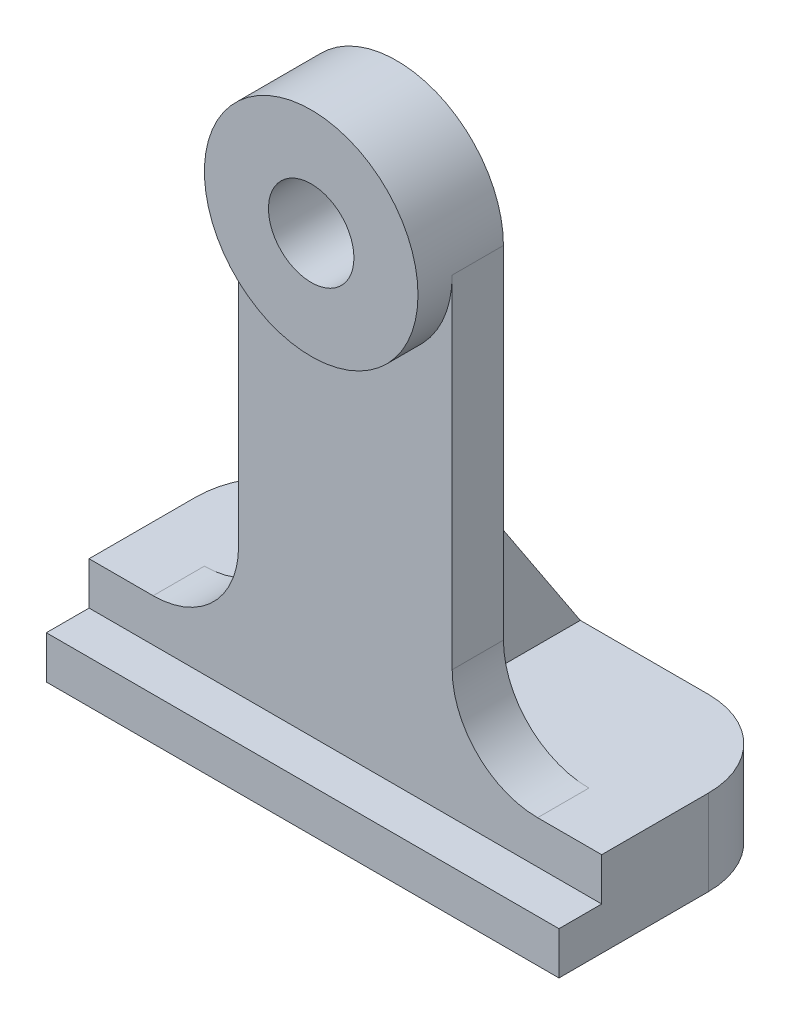
ISO-10303-21;
HEADER;
FILE_DESCRIPTION(('STEP AP214'),'2;1');
FILE_NAME('part.step','',(''),(''),'','','');
FILE_SCHEMA(('AUTOMOTIVE_DESIGN { 1 0 10303 214 1 1 1 1 }'));
ENDSEC;
DATA;
#1=APPLICATION_CONTEXT('core data for automotive mechanical design processes');
#2=APPLICATION_PROTOCOL_DEFINITION('international standard','automotive_design',2000,#1);
#3=PRODUCT_CONTEXT('',#1,'mechanical');
#4=PRODUCT('Part','Part','',(#3));
#5=PRODUCT_RELATED_PRODUCT_CATEGORY('part','',(#4));
#6=PRODUCT_DEFINITION_FORMATION('','',#4);
#7=PRODUCT_DEFINITION_CONTEXT('part definition',#1,'design');
#8=PRODUCT_DEFINITION('design','',#6,#7);
#9=PRODUCT_DEFINITION_SHAPE('','',#8);
#10=(LENGTH_UNIT() NAMED_UNIT(*) SI_UNIT(.MILLI.,.METRE.));
#11=(NAMED_UNIT(*) PLANE_ANGLE_UNIT() SI_UNIT($,.RADIAN.));
#12=(NAMED_UNIT(*) SI_UNIT($,.STERADIAN.) SOLID_ANGLE_UNIT());
#13=UNCERTAINTY_MEASURE_WITH_UNIT(LENGTH_MEASURE(1.E-05),#10,'distance_accuracy_value','');
#14=(GEOMETRIC_REPRESENTATION_CONTEXT(3) GLOBAL_UNCERTAINTY_ASSIGNED_CONTEXT((#13)) GLOBAL_UNIT_ASSIGNED_CONTEXT((#10,
#11,#12)) REPRESENTATION_CONTEXT('',''));
#15=CARTESIAN_POINT('',(0.,0.,0.));
#16=DIRECTION('',(0.,0.,1.));
#17=DIRECTION('',(1.,0.,0.));
#18=AXIS2_PLACEMENT_3D('',#15,#16,#17);
#19=CARTESIAN_POINT('',(0.,0.,0.));
#20=DIRECTION('',(0.,0.,1.));
#21=DIRECTION('',(1.,0.,0.));
#22=AXIS2_PLACEMENT_3D('',#19,#20,#21);
#23=PLANE('',#22);
#24=CARTESIAN_POINT('',(0.,0.,0.));
#25=DIRECTION('',(0.,0.,1.));
#26=DIRECTION('',(1.,0.,0.));
#27=AXIS2_PLACEMENT_3D('',#24,#25,#26);
#28=CIRCLE('',#27,0.25);
#29=CARTESIAN_POINT('',(0.25,0.,0.));
#30=VERTEX_POINT('',#29);
#31=EDGE_CURVE('E249',#30,#30,#28,.T.);
#32=ORIENTED_EDGE('',*,*,#31,.T.);
#33=EDGE_LOOP('',(#32));
#34=FACE_BOUND('',#33,.T.);
#35=DIRECTION('',(0.,-1.,0.));
#36=VECTOR('',#35,1.);
#37=CARTESIAN_POINT('',(0.25,-2.5,0.));
#38=LINE('',#37,#36);
#39=CARTESIAN_POINT('',(0.25,-1.25,0.));
#40=VERTEX_POINT('',#39);
#41=CARTESIAN_POINT('',(0.25,-2.5,0.));
#42=VERTEX_POINT('',#41);
#43=EDGE_CURVE('E571',#40,#42,#38,.T.);
#44=ORIENTED_EDGE('',*,*,#43,.F.);
#45=DIRECTION('',(-1.,0.,0.));
#46=VECTOR('',#45,1.);
#47=CARTESIAN_POINT('',(0.25,-1.25,0.));
#48=LINE('',#47,#46);
#49=CARTESIAN_POINT('',(-0.25,-1.25,0.));
#50=VERTEX_POINT('',#49);
#51=EDGE_CURVE('E180',#40,#50,#48,.T.);
#52=ORIENTED_EDGE('',*,*,#51,.T.);
#53=DIRECTION('',(0.,-1.,0.));
#54=VECTOR('',#53,1.);
#55=CARTESIAN_POINT('',(-0.25,-2.5,0.));
#56=LINE('',#55,#54);
#57=CARTESIAN_POINT('',(-0.25,-2.5,0.));
#58=VERTEX_POINT('',#57);
#59=EDGE_CURVE('E171',#50,#58,#56,.T.);
#60=ORIENTED_EDGE('',*,*,#59,.T.);
#61=DIRECTION('',(1.,0.,0.));
#62=VECTOR('',#61,1.);
#63=CARTESIAN_POINT('',(0.625,-2.5,0.));
#64=LINE('',#63,#62);
#65=CARTESIAN_POINT('',(-1.125,-2.5,0.));
#66=VERTEX_POINT('',#65);
#67=EDGE_CURVE('E166',#66,#58,#64,.T.);
#68=ORIENTED_EDGE('',*,*,#67,.F.);
#69=CARTESIAN_POINT('',(-1.125,-2.,0.));
#70=DIRECTION('',(0.,0.,1.));
#71=DIRECTION('',(1.,0.,0.));
#72=AXIS2_PLACEMENT_3D('',#69,#70,#71);
#73=CIRCLE('',#72,0.5);
#74=CARTESIAN_POINT('',(-0.625,-2.,0.));
#75=VERTEX_POINT('',#74);
#76=EDGE_CURVE('E269',#66,#75,#73,.T.);
#77=ORIENTED_EDGE('',*,*,#76,.T.);
#78=DIRECTION('',(0.,-1.,0.));
#79=VECTOR('',#78,1.);
#80=CARTESIAN_POINT('',(-0.625,-2.5,0.));
#81=LINE('',#80,#79);
#82=CARTESIAN_POINT('',(-0.625,0.,0.));
#83=VERTEX_POINT('',#82);
#84=EDGE_CURVE('E223',#83,#75,#81,.T.);
#85=ORIENTED_EDGE('',*,*,#84,.F.);
#86=CARTESIAN_POINT('',(0.,0.,0.));
#87=DIRECTION('',(0.,0.,1.));
#88=DIRECTION('',(1.,0.,0.));
#89=AXIS2_PLACEMENT_3D('',#86,#87,#88);
#90=CIRCLE('',#89,0.625);
#91=CARTESIAN_POINT('',(0.625,0.,0.));
#92=VERTEX_POINT('',#91);
#93=EDGE_CURVE('E253',#92,#83,#90,.T.);
#94=ORIENTED_EDGE('',*,*,#93,.F.);
#95=DIRECTION('',(0.,1.,0.));
#96=VECTOR('',#95,1.);
#97=CARTESIAN_POINT('',(0.625,0.,0.));
#98=LINE('',#97,#96);
#99=CARTESIAN_POINT('',(0.625,-2.,0.));
#100=VERTEX_POINT('',#99);
#101=EDGE_CURVE('E233',#100,#92,#98,.T.);
#102=ORIENTED_EDGE('',*,*,#101,.F.);
#103=CARTESIAN_POINT('',(1.125,-2.,0.));
#104=DIRECTION('',(0.,0.,1.));
#105=DIRECTION('',(1.,0.,0.));
#106=AXIS2_PLACEMENT_3D('',#103,#104,#105);
#107=CIRCLE('',#106,0.5);
#108=CARTESIAN_POINT('',(1.125,-2.5,0.));
#109=VERTEX_POINT('',#108);
#110=EDGE_CURVE('E273',#100,#109,#107,.T.);
#111=ORIENTED_EDGE('',*,*,#110,.T.);
#112=EDGE_CURVE('E238',#42,#109,#64,.T.);
#113=ORIENTED_EDGE('',*,*,#112,.F.);
#114=EDGE_LOOP('',(#44,#52,#60,#68,#77,#85,#94,#102,#111,#113));
#115=FACE_BOUND('',#114,.T.);
#116=ADVANCED_FACE('F32',(#34,#115),#23,.F.);
#117=CARTESIAN_POINT('',(1.5,-2.5,-0.825));
#118=DIRECTION('',(0.,1.,0.));
#119=DIRECTION('',(-1.,0.,0.));
#120=AXIS2_PLACEMENT_3D('',#117,#118,#119);
#121=PLANE('',#120);
#122=DIRECTION('',(0.,0.,1.));
#123=VECTOR('',#122,1.);
#124=CARTESIAN_POINT('',(1.5,-2.5,-0.825));
#125=LINE('',#124,#123);
#126=CARTESIAN_POINT('',(1.5,-2.5,-0.325));
#127=VERTEX_POINT('',#126);
#128=CARTESIAN_POINT('',(1.5,-2.5,0.3));
#129=VERTEX_POINT('',#128);
#130=EDGE_CURVE('E221',#127,#129,#125,.T.);
#131=ORIENTED_EDGE('',*,*,#130,.F.);
#132=CARTESIAN_POINT('',(1.,-2.5,-0.325));
#133=DIRECTION('',(0.,1.,0.));
#134=DIRECTION('',(-1.,0.,0.));
#135=AXIS2_PLACEMENT_3D('',#132,#133,#134);
#136=CIRCLE('',#135,0.5);
#137=CARTESIAN_POINT('',(1.,-2.5,-0.825));
#138=VERTEX_POINT('',#137);
#139=EDGE_CURVE('E11',#127,#138,#136,.T.);
#140=ORIENTED_EDGE('',*,*,#139,.T.);
#141=DIRECTION('',(-1.,0.,0.));
#142=VECTOR('',#141,1.);
#143=CARTESIAN_POINT('',(0.625,-2.5,-0.825));
#144=LINE('',#143,#142);
#145=CARTESIAN_POINT('',(0.25,-2.5,-0.825));
#146=VERTEX_POINT('',#145);
#147=EDGE_CURVE('E158',#138,#146,#144,.T.);
#148=ORIENTED_EDGE('',*,*,#147,.T.);
#149=DIRECTION('',(0.,0.,-1.));
#150=VECTOR('',#149,1.);
#151=CARTESIAN_POINT('',(0.25,-2.5,-0.825));
#152=LINE('',#151,#150);
#153=EDGE_CURVE('E181',#42,#146,#152,.T.);
#154=ORIENTED_EDGE('',*,*,#153,.F.);
#155=ORIENTED_EDGE('',*,*,#112,.T.);
#156=DIRECTION('',(0.,0.,-1.));
#157=VECTOR('',#156,1.);
#158=CARTESIAN_POINT('',(1.125,-2.5,-0.825));
#159=LINE('',#158,#157);
#160=CARTESIAN_POINT('',(1.125,-2.5,0.3));
#161=VERTEX_POINT('',#160);
#162=EDGE_CURVE('E259',#109,#161,#159,.F.);
#163=ORIENTED_EDGE('',*,*,#162,.T.);
#164=DIRECTION('',(-1.,0.,0.));
#165=VECTOR('',#164,1.);
#166=CARTESIAN_POINT('',(1.5,-2.5,0.3));
#167=LINE('',#166,#165);
#168=EDGE_CURVE('E159',#129,#161,#167,.T.);
#169=ORIENTED_EDGE('',*,*,#168,.F.);
#170=EDGE_LOOP('',(#131,#140,#148,#154,#155,#163,#169));
#171=FACE_BOUND('',#170,.T.);
#172=ADVANCED_FACE('F298',(#171),#121,.T.);
#173=CARTESIAN_POINT('',(0.,0.,0.3));
#174=DIRECTION('',(0.,0.,-1.));
#175=DIRECTION('',(-1.,0.,0.));
#176=AXIS2_PLACEMENT_3D('',#173,#174,#175);
#177=PLANE('',#176);
#178=DIRECTION('',(-1.,0.,0.));
#179=VECTOR('',#178,1.);
#180=CARTESIAN_POINT('',(1.5,-2.75,0.3));
#181=LINE('',#180,#179);
#182=CARTESIAN_POINT('',(1.5,-2.75,0.3));
#183=VERTEX_POINT('',#182);
#184=CARTESIAN_POINT('',(-1.5,-2.75,0.3));
#185=VERTEX_POINT('',#184);
#186=EDGE_CURVE('E190',#183,#185,#181,.T.);
#187=ORIENTED_EDGE('',*,*,#186,.F.);
#188=DIRECTION('',(0.,1.,0.));
#189=VECTOR('',#188,1.);
#190=CARTESIAN_POINT('',(1.5,-3.,0.3));
#191=LINE('',#190,#189);
#192=EDGE_CURVE('E215',#183,#129,#191,.T.);
#193=ORIENTED_EDGE('',*,*,#192,.T.);
#194=ORIENTED_EDGE('',*,*,#168,.T.);
#195=CARTESIAN_POINT('',(1.125,-2.,0.3));
#196=DIRECTION('',(0.,0.,-1.));
#197=DIRECTION('',(-1.,0.,0.));
#198=AXIS2_PLACEMENT_3D('',#195,#196,#197);
#199=CIRCLE('',#198,0.5);
#200=CARTESIAN_POINT('',(0.625,-2.,0.3));
#201=VERTEX_POINT('',#200);
#202=EDGE_CURVE('E276',#161,#201,#199,.T.);
#203=ORIENTED_EDGE('',*,*,#202,.T.);
#204=DIRECTION('',(0.,1.,0.));
#205=VECTOR('',#204,1.);
#206=CARTESIAN_POINT('',(0.625,0.,0.3));
#207=LINE('',#206,#205);
#208=CARTESIAN_POINT('',(0.625,0.,0.3));
#209=VERTEX_POINT('',#208);
#210=EDGE_CURVE('E232',#201,#209,#207,.T.);
#211=ORIENTED_EDGE('',*,*,#210,.T.);
#212=CARTESIAN_POINT('',(0.,0.,0.3));
#213=DIRECTION('',(0.,0.,-1.));
#214=DIRECTION('',(-1.,0.,0.));
#215=AXIS2_PLACEMENT_3D('',#212,#213,#214);
#216=CIRCLE('',#215,0.625);
#217=CARTESIAN_POINT('',(-0.625,0.,0.3));
#218=VERTEX_POINT('',#217);
#219=EDGE_CURVE('E246',#209,#218,#216,.T.);
#220=ORIENTED_EDGE('',*,*,#219,.T.);
#221=DIRECTION('',(0.,-1.,0.));
#222=VECTOR('',#221,1.);
#223=CARTESIAN_POINT('',(-0.625,-2.5,0.3));
#224=LINE('',#223,#222);
#225=CARTESIAN_POINT('',(-0.625,-2.,0.3));
#226=VERTEX_POINT('',#225);
#227=EDGE_CURVE('E229',#218,#226,#224,.T.);
#228=ORIENTED_EDGE('',*,*,#227,.T.);
#229=CARTESIAN_POINT('',(-1.125,-2.,0.3));
#230=DIRECTION('',(0.,0.,-1.));
#231=DIRECTION('',(-1.,0.,0.));
#232=AXIS2_PLACEMENT_3D('',#229,#230,#231);
#233=CIRCLE('',#232,0.5);
#234=CARTESIAN_POINT('',(-1.125,-2.5,0.3));
#235=VERTEX_POINT('',#234);
#236=EDGE_CURVE('E271',#226,#235,#233,.T.);
#237=ORIENTED_EDGE('',*,*,#236,.T.);
#238=CARTESIAN_POINT('',(-1.5,-2.5,0.3));
#239=VERTEX_POINT('',#238);
#240=EDGE_CURVE('E218',#235,#239,#167,.T.);
#241=ORIENTED_EDGE('',*,*,#240,.T.);
#242=DIRECTION('',(0.,-1.,0.));
#243=VECTOR('',#242,1.);
#244=CARTESIAN_POINT('',(-1.5,-2.5,0.3));
#245=LINE('',#244,#243);
#246=EDGE_CURVE('E208',#239,#185,#245,.T.);
#247=ORIENTED_EDGE('',*,*,#246,.T.);
#248=EDGE_LOOP('',(#187,#193,#194,#203,#211,#220,#228,#237,#241,#247));
#249=FACE_BOUND('',#248,.T.);
#250=ADVANCED_FACE('F302',(#249),#177,.F.);
#251=CARTESIAN_POINT('',(0.,0.,0.5));
#252=DIRECTION('',(0.,0.,-1.));
#253=DIRECTION('',(-1.,0.,0.));
#254=AXIS2_PLACEMENT_3D('',#251,#252,#253);
#255=CYLINDRICAL_SURFACE('',#254,0.625);
#256=CARTESIAN_POINT('',(0.,0.,0.5));
#257=DIRECTION('',(0.,0.,1.));
#258=DIRECTION('',(1.,0.,0.));
#259=AXIS2_PLACEMENT_3D('',#256,#257,#258);
#260=CIRCLE('',#259,0.625);
#261=CARTESIAN_POINT('',(0.625,0.,0.5));
#262=VERTEX_POINT('',#261);
#263=EDGE_CURVE('E256',#262,#262,#260,.T.);
#264=ORIENTED_EDGE('',*,*,#263,.F.);
#265=EDGE_LOOP('',(#264));
#266=FACE_BOUND('',#265,.T.);
#267=DIRECTION('',(0.,0.,-1.));
#268=VECTOR('',#267,1.);
#269=CARTESIAN_POINT('',(-0.625,0.,0.3));
#270=LINE('',#269,#268);
#271=EDGE_CURVE('E243',#218,#83,#270,.T.);
#272=ORIENTED_EDGE('',*,*,#271,.F.);
#273=ORIENTED_EDGE('',*,*,#219,.F.);
#274=DIRECTION('',(0.,0.,-1.));
#275=VECTOR('',#274,1.);
#276=CARTESIAN_POINT('',(0.625,0.,0.3));
#277=LINE('',#276,#275);
#278=EDGE_CURVE('E235',#209,#92,#277,.T.);
#279=ORIENTED_EDGE('',*,*,#278,.T.);
#280=ORIENTED_EDGE('',*,*,#93,.T.);
#281=EDGE_LOOP('',(#272,#273,#279,#280));
#282=FACE_BOUND('',#281,.T.);
#283=ADVANCED_FACE('F317',(#266,#282),#255,.T.);
#284=CARTESIAN_POINT('',(0.,0.,0.5));
#285=DIRECTION('',(0.,0.,-1.));
#286=DIRECTION('',(-1.,0.,0.));
#287=AXIS2_PLACEMENT_3D('',#284,#285,#286);
#288=CYLINDRICAL_SURFACE('',#287,0.25);
#289=CARTESIAN_POINT('',(0.,0.,0.5));
#290=DIRECTION('',(0.,0.,1.));
#291=DIRECTION('',(1.,0.,0.));
#292=AXIS2_PLACEMENT_3D('',#289,#290,#291);
#293=CIRCLE('',#292,0.25);
#294=CARTESIAN_POINT('',(0.25,0.,0.5));
#295=VERTEX_POINT('',#294);
#296=EDGE_CURVE('E250',#295,#295,#293,.T.);
#297=ORIENTED_EDGE('',*,*,#296,.T.);
#298=EDGE_LOOP('',(#297));
#299=FACE_BOUND('',#298,.T.);
#300=ORIENTED_EDGE('',*,*,#31,.F.);
#301=EDGE_LOOP('',(#300));
#302=FACE_BOUND('',#301,.T.);
#303=ADVANCED_FACE('F371',(#299,#302),#288,.F.);
#304=CARTESIAN_POINT('',(0.,0.,0.5));
#305=DIRECTION('',(0.,0.,1.));
#306=DIRECTION('',(1.,0.,0.));
#307=AXIS2_PLACEMENT_3D('',#304,#305,#306);
#308=PLANE('',#307);
#309=ORIENTED_EDGE('',*,*,#263,.T.);
#310=EDGE_LOOP('',(#309));
#311=FACE_BOUND('',#310,.T.);
#312=ORIENTED_EDGE('',*,*,#296,.F.);
#313=EDGE_LOOP('',(#312));
#314=FACE_BOUND('',#313,.T.);
#315=ADVANCED_FACE('F367',(#311,#314),#308,.T.);
#316=CARTESIAN_POINT('',(-0.625,-2.5,0.3));
#317=DIRECTION('',(1.,0.,0.));
#318=DIRECTION('',(0.,1.,0.));
#319=AXIS2_PLACEMENT_3D('',#316,#317,#318);
#320=PLANE('',#319);
#321=ORIENTED_EDGE('',*,*,#84,.T.);
#322=DIRECTION('',(0.,0.,-1.));
#323=VECTOR('',#322,1.);
#324=CARTESIAN_POINT('',(-0.625,-2.,0.3));
#325=LINE('',#324,#323);
#326=EDGE_CURVE('E264',#75,#226,#325,.F.);
#327=ORIENTED_EDGE('',*,*,#326,.T.);
#328=ORIENTED_EDGE('',*,*,#227,.F.);
#329=ORIENTED_EDGE('',*,*,#271,.T.);
#330=EDGE_LOOP('',(#321,#327,#328,#329));
#331=FACE_BOUND('',#330,.T.);
#332=ADVANCED_FACE('F321',(#331),#320,.F.);
#333=CARTESIAN_POINT('',(0.625,0.,0.3));
#334=DIRECTION('',(-1.,0.,0.));
#335=DIRECTION('',(0.,-1.,0.));
#336=AXIS2_PLACEMENT_3D('',#333,#334,#335);
#337=PLANE('',#336);
#338=ORIENTED_EDGE('',*,*,#210,.F.);
#339=DIRECTION('',(0.,0.,-1.));
#340=VECTOR('',#339,1.);
#341=CARTESIAN_POINT('',(0.625,-2.,0.3));
#342=LINE('',#341,#340);
#343=EDGE_CURVE('E266',#201,#100,#342,.T.);
#344=ORIENTED_EDGE('',*,*,#343,.T.);
#345=ORIENTED_EDGE('',*,*,#101,.T.);
#346=ORIENTED_EDGE('',*,*,#278,.F.);
#347=EDGE_LOOP('',(#338,#344,#345,#346));
#348=FACE_BOUND('',#347,.T.);
#349=ADVANCED_FACE('F309',(#348),#337,.F.);
#350=CARTESIAN_POINT('',(-0.25,-2.5,-0.825));
#351=VERTEX_POINT('',#350);
#352=CARTESIAN_POINT('',(-1.,-2.5,-0.825));
#353=VERTEX_POINT('',#352);
#354=EDGE_CURVE('E149',#351,#353,#144,.T.);
#355=ORIENTED_EDGE('',*,*,#354,.T.);
#356=CARTESIAN_POINT('',(-1.,-2.5,-0.325));
#357=DIRECTION('',(0.,1.,0.));
#358=DIRECTION('',(-1.,0.,0.));
#359=AXIS2_PLACEMENT_3D('',#356,#357,#358);
#360=CIRCLE('',#359,0.5);
#361=CARTESIAN_POINT('',(-1.5,-2.5,-0.325));
#362=VERTEX_POINT('',#361);
#363=EDGE_CURVE('E288',#353,#362,#360,.T.);
#364=ORIENTED_EDGE('',*,*,#363,.T.);
#365=DIRECTION('',(0.,0.,1.));
#366=VECTOR('',#365,1.);
#367=CARTESIAN_POINT('',(-1.5,-2.5,-0.825));
#368=LINE('',#367,#366);
#369=EDGE_CURVE('E213',#362,#239,#368,.T.);
#370=ORIENTED_EDGE('',*,*,#369,.T.);
#371=ORIENTED_EDGE('',*,*,#240,.F.);
#372=DIRECTION('',(0.,0.,-1.));
#373=VECTOR('',#372,1.);
#374=CARTESIAN_POINT('',(-1.125,-2.5,-0.825));
#375=LINE('',#374,#373);
#376=EDGE_CURVE('E262',#235,#66,#375,.T.);
#377=ORIENTED_EDGE('',*,*,#376,.T.);
#378=ORIENTED_EDGE('',*,*,#67,.T.);
#379=DIRECTION('',(0.,0.,-1.));
#380=VECTOR('',#379,1.);
#381=CARTESIAN_POINT('',(-0.25,-2.5,-0.825));
#382=LINE('',#381,#380);
#383=EDGE_CURVE('E163',#58,#351,#382,.T.);
#384=ORIENTED_EDGE('',*,*,#383,.T.);
#385=EDGE_LOOP('',(#355,#364,#370,#371,#377,#378,#384));
#386=FACE_BOUND('',#385,.T.);
#387=ADVANCED_FACE('F164',(#386),#121,.T.);
#388=CARTESIAN_POINT('',(1.5,-3.,-0.825));
#389=DIRECTION('',(1.,0.,0.));
#390=DIRECTION('',(0.,0.,-1.));
#391=AXIS2_PLACEMENT_3D('',#388,#389,#390);
#392=PLANE('',#391);
#393=DIRECTION('',(0.,0.,1.));
#394=VECTOR('',#393,1.);
#395=CARTESIAN_POINT('',(1.5,-3.,-0.825));
#396=LINE('',#395,#394);
#397=CARTESIAN_POINT('',(1.5,-3.,-0.325));
#398=VERTEX_POINT('',#397);
#399=CARTESIAN_POINT('',(1.5,-3.,0.55));
#400=VERTEX_POINT('',#399);
#401=EDGE_CURVE('E224',#398,#400,#396,.T.);
#402=ORIENTED_EDGE('',*,*,#401,.F.);
#403=DIRECTION('',(0.,1.,0.));
#404=VECTOR('',#403,1.);
#405=CARTESIAN_POINT('',(1.5,-2.5,-0.325));
#406=LINE('',#405,#404);
#407=EDGE_CURVE('E40',#398,#127,#406,.T.);
#408=ORIENTED_EDGE('',*,*,#407,.T.);
#409=ORIENTED_EDGE('',*,*,#130,.T.);
#410=ORIENTED_EDGE('',*,*,#192,.F.);
#411=DIRECTION('',(0.,0.,-1.));
#412=VECTOR('',#411,1.);
#413=CARTESIAN_POINT('',(1.5,-2.75,0.55));
#414=LINE('',#413,#412);
#415=CARTESIAN_POINT('',(1.5,-2.75,0.55));
#416=VERTEX_POINT('',#415);
#417=EDGE_CURVE('E206',#416,#183,#414,.T.);
#418=ORIENTED_EDGE('',*,*,#417,.F.);
#419=DIRECTION('',(0.,1.,0.));
#420=VECTOR('',#419,1.);
#421=CARTESIAN_POINT('',(1.5,-3.,0.55));
#422=LINE('',#421,#420);
#423=EDGE_CURVE('E194',#400,#416,#422,.T.);
#424=ORIENTED_EDGE('',*,*,#423,.F.);
#425=EDGE_LOOP('',(#402,#408,#409,#410,#418,#424));
#426=FACE_BOUND('',#425,.T.);
#427=ADVANCED_FACE('F292',(#426),#392,.T.);
#428=CARTESIAN_POINT('',(-1.5,-3.,-0.825));
#429=DIRECTION('',(0.,-1.,0.));
#430=DIRECTION('',(0.,0.,-1.));
#431=AXIS2_PLACEMENT_3D('',#428,#429,#430);
#432=PLANE('',#431);
#433=DIRECTION('',(0.,0.,1.));
#434=VECTOR('',#433,1.);
#435=CARTESIAN_POINT('',(-1.5,-3.,-0.825));
#436=LINE('',#435,#434);
#437=CARTESIAN_POINT('',(-1.5,-3.,-0.325));
#438=VERTEX_POINT('',#437);
#439=CARTESIAN_POINT('',(-1.5,-3.,0.55));
#440=VERTEX_POINT('',#439);
#441=EDGE_CURVE('E226',#438,#440,#436,.T.);
#442=ORIENTED_EDGE('',*,*,#441,.F.);
#443=CARTESIAN_POINT('',(-1.,-3.,-0.325));
#444=DIRECTION('',(0.,-1.,0.));
#445=DIRECTION('',(0.,0.,-1.));
#446=AXIS2_PLACEMENT_3D('',#443,#444,#445);
#447=CIRCLE('',#446,0.5);
#448=CARTESIAN_POINT('',(-1.,-3.,-0.825));
#449=VERTEX_POINT('',#448);
#450=EDGE_CURVE('E283',#438,#449,#447,.T.);
#451=ORIENTED_EDGE('',*,*,#450,.T.);
#452=DIRECTION('',(1.,0.,0.));
#453=VECTOR('',#452,1.);
#454=CARTESIAN_POINT('',(-1.5,-3.,-0.825));
#455=LINE('',#454,#453);
#456=CARTESIAN_POINT('',(1.,-3.,-0.825));
#457=VERTEX_POINT('',#456);
#458=EDGE_CURVE('E210',#449,#457,#455,.T.);
#459=ORIENTED_EDGE('',*,*,#458,.T.);
#460=CARTESIAN_POINT('',(1.,-3.,-0.325));
#461=DIRECTION('',(0.,-1.,0.));
#462=DIRECTION('',(0.,0.,-1.));
#463=AXIS2_PLACEMENT_3D('',#460,#461,#462);
#464=CIRCLE('',#463,0.5);
#465=EDGE_CURVE('E281',#457,#398,#464,.T.);
#466=ORIENTED_EDGE('',*,*,#465,.T.);
#467=ORIENTED_EDGE('',*,*,#401,.T.);
#468=DIRECTION('',(1.,0.,0.));
#469=VECTOR('',#468,1.);
#470=CARTESIAN_POINT('',(-1.5,-3.,0.55));
#471=LINE('',#470,#469);
#472=EDGE_CURVE('E191',#440,#400,#471,.T.);
#473=ORIENTED_EDGE('',*,*,#472,.F.);
#474=EDGE_LOOP('',(#442,#451,#459,#466,#467,#473));
#475=FACE_BOUND('',#474,.T.);
#476=ADVANCED_FACE('F338',(#475),#432,.T.);
#477=CARTESIAN_POINT('',(-1.5,-2.5,-0.825));
#478=DIRECTION('',(-1.,0.,0.));
#479=DIRECTION('',(0.,0.,1.));
#480=AXIS2_PLACEMENT_3D('',#477,#478,#479);
#481=PLANE('',#480);
#482=ORIENTED_EDGE('',*,*,#369,.F.);
#483=DIRECTION('',(0.,-1.,0.));
#484=VECTOR('',#483,1.);
#485=CARTESIAN_POINT('',(-1.5,-3.,-0.325));
#486=LINE('',#485,#484);
#487=EDGE_CURVE('E278',#362,#438,#486,.T.);
#488=ORIENTED_EDGE('',*,*,#487,.T.);
#489=ORIENTED_EDGE('',*,*,#441,.T.);
#490=DIRECTION('',(0.,-1.,0.));
#491=VECTOR('',#490,1.);
#492=CARTESIAN_POINT('',(-1.5,-2.75,0.55));
#493=LINE('',#492,#491);
#494=CARTESIAN_POINT('',(-1.5,-2.75,0.55));
#495=VERTEX_POINT('',#494);
#496=EDGE_CURVE('E198',#495,#440,#493,.T.);
#497=ORIENTED_EDGE('',*,*,#496,.F.);
#498=DIRECTION('',(0.,0.,-1.));
#499=VECTOR('',#498,1.);
#500=CARTESIAN_POINT('',(-1.5,-2.75,0.55));
#501=LINE('',#500,#499);
#502=EDGE_CURVE('E201',#495,#185,#501,.T.);
#503=ORIENTED_EDGE('',*,*,#502,.T.);
#504=ORIENTED_EDGE('',*,*,#246,.F.);
#505=EDGE_LOOP('',(#482,#488,#489,#497,#503,#504));
#506=FACE_BOUND('',#505,.T.);
#507=ADVANCED_FACE('F333',(#506),#481,.T.);
#508=CARTESIAN_POINT('',(0.,0.,-0.825));
#509=DIRECTION('',(0.,0.,1.));
#510=DIRECTION('',(1.,0.,0.));
#511=AXIS2_PLACEMENT_3D('',#508,#509,#510);
#512=PLANE('',#511);
#513=ORIENTED_EDGE('',*,*,#458,.F.);
#514=DIRECTION('',(0.,-1.,0.));
#515=VECTOR('',#514,1.);
#516=CARTESIAN_POINT('',(-1.,-2.5,-0.825));
#517=LINE('',#516,#515);
#518=EDGE_CURVE('E53',#449,#353,#517,.F.);
#519=ORIENTED_EDGE('',*,*,#518,.T.);
#520=ORIENTED_EDGE('',*,*,#354,.F.);
#521=DIRECTION('',(-1.,0.,0.));
#522=VECTOR('',#521,1.);
#523=CARTESIAN_POINT('',(0.25,-2.5,-0.825));
#524=LINE('',#523,#522);
#525=EDGE_CURVE('E154',#146,#351,#524,.T.);
#526=ORIENTED_EDGE('',*,*,#525,.F.);
#527=ORIENTED_EDGE('',*,*,#147,.F.);
#528=DIRECTION('',(0.,1.,0.));
#529=VECTOR('',#528,1.);
#530=CARTESIAN_POINT('',(1.,-3.,-0.825));
#531=LINE('',#530,#529);
#532=EDGE_CURVE('E285',#138,#457,#531,.F.);
#533=ORIENTED_EDGE('',*,*,#532,.T.);
#534=EDGE_LOOP('',(#513,#519,#520,#526,#527,#533));
#535=FACE_BOUND('',#534,.T.);
#536=ADVANCED_FACE('F151',(#535),#512,.F.);
#537=CARTESIAN_POINT('',(1.5,-2.75,0.55));
#538=DIRECTION('',(0.,-1.,0.));
#539=DIRECTION('',(1.,0.,0.));
#540=AXIS2_PLACEMENT_3D('',#537,#538,#539);
#541=PLANE('',#540);
#542=ORIENTED_EDGE('',*,*,#186,.T.);
#543=ORIENTED_EDGE('',*,*,#502,.F.);
#544=DIRECTION('',(-1.,0.,0.));
#545=VECTOR('',#544,1.);
#546=CARTESIAN_POINT('',(1.5,-2.75,0.55));
#547=LINE('',#546,#545);
#548=EDGE_CURVE('E196',#416,#495,#547,.T.);
#549=ORIENTED_EDGE('',*,*,#548,.F.);
#550=ORIENTED_EDGE('',*,*,#417,.T.);
#551=EDGE_LOOP('',(#542,#543,#549,#550));
#552=FACE_BOUND('',#551,.T.);
#553=ADVANCED_FACE('F347',(#552),#541,.F.);
#554=CARTESIAN_POINT('',(0.,0.,0.55));
#555=DIRECTION('',(0.,0.,1.));
#556=DIRECTION('',(1.,0.,0.));
#557=AXIS2_PLACEMENT_3D('',#554,#555,#556);
#558=PLANE('',#557);
#559=ORIENTED_EDGE('',*,*,#472,.T.);
#560=ORIENTED_EDGE('',*,*,#423,.T.);
#561=ORIENTED_EDGE('',*,*,#548,.T.);
#562=ORIENTED_EDGE('',*,*,#496,.T.);
#563=EDGE_LOOP('',(#559,#560,#561,#562));
#564=FACE_BOUND('',#563,.T.);
#565=ADVANCED_FACE('F343',(#564),#558,.T.);
#566=CARTESIAN_POINT('',(-1.125,-2.,-0.825));
#567=DIRECTION('',(0.,0.,-1.));
#568=DIRECTION('',(-1.,0.,0.));
#569=AXIS2_PLACEMENT_3D('',#566,#567,#568);
#570=CYLINDRICAL_SURFACE('',#569,0.5);
#571=ORIENTED_EDGE('',*,*,#236,.F.);
#572=ORIENTED_EDGE('',*,*,#326,.F.);
#573=ORIENTED_EDGE('',*,*,#76,.F.);
#574=ORIENTED_EDGE('',*,*,#376,.F.);
#575=EDGE_LOOP('',(#571,#572,#573,#574));
#576=FACE_BOUND('',#575,.T.);
#577=ADVANCED_FACE('F325',(#576),#570,.F.);
#578=CARTESIAN_POINT('',(1.125,-2.,0.3));
#579=DIRECTION('',(0.,0.,-1.));
#580=DIRECTION('',(-1.,0.,0.));
#581=AXIS2_PLACEMENT_3D('',#578,#579,#580);
#582=CYLINDRICAL_SURFACE('',#581,0.5);
#583=ORIENTED_EDGE('',*,*,#202,.F.);
#584=ORIENTED_EDGE('',*,*,#162,.F.);
#585=ORIENTED_EDGE('',*,*,#110,.F.);
#586=ORIENTED_EDGE('',*,*,#343,.F.);
#587=EDGE_LOOP('',(#583,#584,#585,#586));
#588=FACE_BOUND('',#587,.T.);
#589=ADVANCED_FACE('F306',(#588),#582,.F.);
#590=CARTESIAN_POINT('',(0.25,-1.25,0.));
#591=DIRECTION('',(0.,-0.550842208330739,0.834609406561725));
#592=DIRECTION('',(0.,-0.834609406561725,-0.550842208330739));
#593=AXIS2_PLACEMENT_3D('',#590,#591,#592);
#594=PLANE('',#593);
#595=DIRECTION('',(0.,0.834609406561725,0.550842208330739));
#596=VECTOR('',#595,1.);
#597=CARTESIAN_POINT('',(-0.25,-1.25,0.));
#598=LINE('',#597,#596);
#599=EDGE_CURVE('E178',#351,#50,#598,.T.);
#600=ORIENTED_EDGE('',*,*,#599,.T.);
#601=ORIENTED_EDGE('',*,*,#51,.F.);
#602=DIRECTION('',(0.,0.834609406561725,0.550842208330739));
#603=VECTOR('',#602,1.);
#604=CARTESIAN_POINT('',(0.25,-1.25,0.));
#605=LINE('',#604,#603);
#606=EDGE_CURVE('E170',#146,#40,#605,.T.);
#607=ORIENTED_EDGE('',*,*,#606,.F.);
#608=ORIENTED_EDGE('',*,*,#525,.T.);
#609=EDGE_LOOP('',(#600,#601,#607,#608));
#610=FACE_BOUND('',#609,.T.);
#611=ADVANCED_FACE('F176',(#610),#594,.F.);
#612=CARTESIAN_POINT('',(0.25,0.,0.));
#613=DIRECTION('',(-1.,0.,0.));
#614=DIRECTION('',(0.,0.,1.));
#615=AXIS2_PLACEMENT_3D('',#612,#613,#614);
#616=PLANE('',#615);
#617=ORIENTED_EDGE('',*,*,#606,.T.);
#618=ORIENTED_EDGE('',*,*,#43,.T.);
#619=ORIENTED_EDGE('',*,*,#153,.T.);
#620=EDGE_LOOP('',(#617,#618,#619));
#621=FACE_BOUND('',#620,.T.);
#622=ADVANCED_FACE('F381',(#621),#616,.F.);
#623=CARTESIAN_POINT('',(-0.25,0.,0.));
#624=DIRECTION('',(-1.,0.,0.));
#625=DIRECTION('',(0.,0.,1.));
#626=AXIS2_PLACEMENT_3D('',#623,#624,#625);
#627=PLANE('',#626);
#628=ORIENTED_EDGE('',*,*,#599,.F.);
#629=ORIENTED_EDGE('',*,*,#383,.F.);
#630=ORIENTED_EDGE('',*,*,#59,.F.);
#631=EDGE_LOOP('',(#628,#629,#630));
#632=FACE_BOUND('',#631,.T.);
#633=ADVANCED_FACE('F183',(#632),#627,.T.);
#634=CARTESIAN_POINT('',(-1.,-2.5,-0.325));
#635=DIRECTION('',(0.,1.,0.));
#636=DIRECTION('',(0.,0.,1.));
#637=AXIS2_PLACEMENT_3D('',#634,#635,#636);
#638=CYLINDRICAL_SURFACE('',#637,0.5);
#639=ORIENTED_EDGE('',*,*,#363,.F.);
#640=ORIENTED_EDGE('',*,*,#518,.F.);
#641=ORIENTED_EDGE('',*,*,#450,.F.);
#642=ORIENTED_EDGE('',*,*,#487,.F.);
#643=EDGE_LOOP('',(#639,#640,#641,#642));
#644=FACE_BOUND('',#643,.T.);
#645=ADVANCED_FACE('F336',(#644),#638,.T.);
#646=CARTESIAN_POINT('',(1.,-3.,-0.325));
#647=DIRECTION('',(0.,-1.,0.));
#648=DIRECTION('',(0.,0.,-1.));
#649=AXIS2_PLACEMENT_3D('',#646,#647,#648);
#650=CYLINDRICAL_SURFACE('',#649,0.5);
#651=ORIENTED_EDGE('',*,*,#465,.F.);
#652=ORIENTED_EDGE('',*,*,#532,.F.);
#653=ORIENTED_EDGE('',*,*,#139,.F.);
#654=ORIENTED_EDGE('',*,*,#407,.F.);
#655=EDGE_LOOP('',(#651,#652,#653,#654));
#656=FACE_BOUND('',#655,.T.);
#657=ADVANCED_FACE('F34',(#656),#650,.T.);
#658=CLOSED_SHELL('',(#116,#172,#250,#283,#303,#315,#332,#349,#387,#427,#476,#507,#536,#553,
#565,#577,#589,#611,#622,#633,#645,#657));
#659=MANIFOLD_SOLID_BREP('B2',#658);
#660=ADVANCED_BREP_SHAPE_REPRESENTATION('',(#18,#659),#14);
#661=SHAPE_DEFINITION_REPRESENTATION(#9,#660);
ENDSEC;
END-ISO-10303-21;
